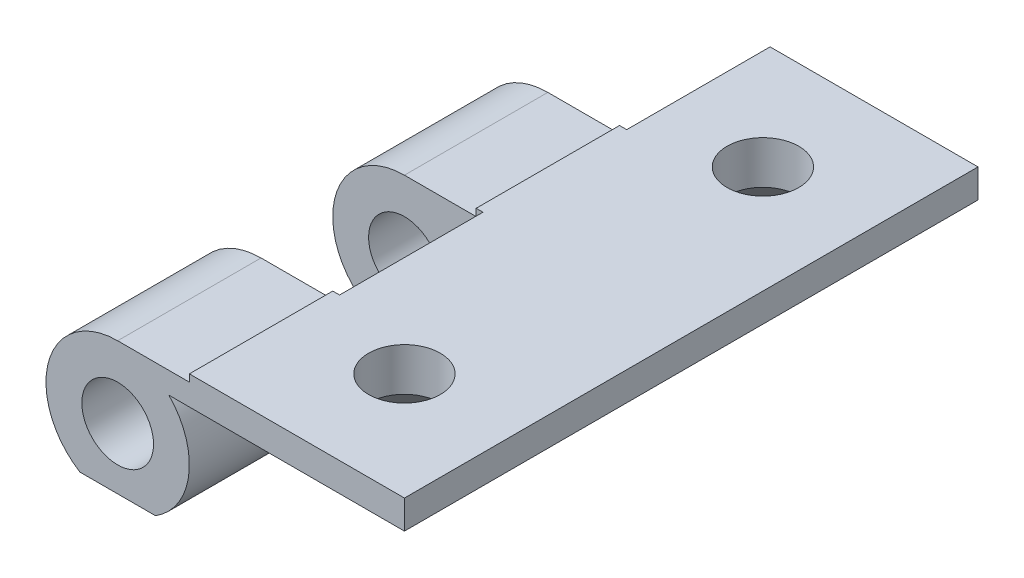
ISO-10303-21;
HEADER;
FILE_DESCRIPTION(('STEP AP214'),'2;1');
FILE_NAME('part.step','',(''),(''),'','','');
FILE_SCHEMA(('AUTOMOTIVE_DESIGN { 1 0 10303 214 1 1 1 1 }'));
ENDSEC;
DATA;
#1=APPLICATION_CONTEXT('core data for automotive mechanical design processes');
#2=APPLICATION_PROTOCOL_DEFINITION('international standard','automotive_design',2000,#1);
#3=PRODUCT_CONTEXT('',#1,'mechanical');
#4=PRODUCT('Part','Part','',(#3));
#5=PRODUCT_RELATED_PRODUCT_CATEGORY('part','',(#4));
#6=PRODUCT_DEFINITION_FORMATION('','',#4);
#7=PRODUCT_DEFINITION_CONTEXT('part definition',#1,'design');
#8=PRODUCT_DEFINITION('design','',#6,#7);
#9=PRODUCT_DEFINITION_SHAPE('','',#8);
#10=(LENGTH_UNIT() NAMED_UNIT(*) SI_UNIT(.MILLI.,.METRE.));
#11=(NAMED_UNIT(*) PLANE_ANGLE_UNIT() SI_UNIT($,.RADIAN.));
#12=(NAMED_UNIT(*) SI_UNIT($,.STERADIAN.) SOLID_ANGLE_UNIT());
#13=UNCERTAINTY_MEASURE_WITH_UNIT(LENGTH_MEASURE(1.E-05),#10,'distance_accuracy_value','');
#14=(GEOMETRIC_REPRESENTATION_CONTEXT(3) GLOBAL_UNCERTAINTY_ASSIGNED_CONTEXT((#13)) GLOBAL_UNIT_ASSIGNED_CONTEXT((#10,
#11,#12)) REPRESENTATION_CONTEXT('',''));
#15=CARTESIAN_POINT('',(0.,0.,0.));
#16=DIRECTION('',(0.,0.,1.));
#17=DIRECTION('',(1.,0.,0.));
#18=AXIS2_PLACEMENT_3D('',#15,#16,#17);
#19=CARTESIAN_POINT('',(20.,0.500000000000001,40.));
#20=DIRECTION('',(0.,1.,0.));
#21=DIRECTION('',(0.,0.,1.));
#22=AXIS2_PLACEMENT_3D('',#19,#20,#21);
#23=PLANE('',#22);
#24=DIRECTION('',(1.,0.,0.));
#25=VECTOR('',#24,1.);
#26=CARTESIAN_POINT('',(20.,0.500000000000001,3.00000000000002));
#27=LINE('',#26,#25);
#28=CARTESIAN_POINT('',(5.5,0.500000000000001,3.00000000000002));
#29=VERTEX_POINT('',#28);
#30=CARTESIAN_POINT('',(12.5,0.500000000000001,3.00000000000002));
#31=VERTEX_POINT('',#30);
#32=EDGE_CURVE('E288',#29,#31,#27,.T.);
#33=ORIENTED_EDGE('',*,*,#32,.T.);
#34=CARTESIAN_POINT('',(12.5,0.500000000000001,7.5));
#35=DIRECTION('',(0.,1.,0.));
#36=DIRECTION('',(0.,0.,1.));
#37=AXIS2_PLACEMENT_3D('',#34,#35,#36);
#38=CIRCLE('',#37,4.50000000000001);
#39=CARTESIAN_POINT('',(17.,0.500000000000001,7.5));
#40=VERTEX_POINT('',#39);
#41=EDGE_CURVE('E52',#31,#40,#38,.T.);
#42=ORIENTED_EDGE('',*,*,#41,.T.);
#43=DIRECTION('',(0.,0.,1.));
#44=VECTOR('',#43,1.);
#45=CARTESIAN_POINT('',(17.,0.500000000000001,40.));
#46=LINE('',#45,#44);
#47=CARTESIAN_POINT('',(17.,0.500000000000001,32.5));
#48=VERTEX_POINT('',#47);
#49=EDGE_CURVE('E287',#40,#48,#46,.T.);
#50=ORIENTED_EDGE('',*,*,#49,.T.);
#51=CARTESIAN_POINT('',(12.5,0.500000000000001,32.5));
#52=DIRECTION('',(0.,1.,0.));
#53=DIRECTION('',(0.,0.,1.));
#54=AXIS2_PLACEMENT_3D('',#51,#52,#53);
#55=CIRCLE('',#54,4.50000000000001);
#56=CARTESIAN_POINT('',(12.5,0.500000000000001,37.));
#57=VERTEX_POINT('',#56);
#58=EDGE_CURVE('E59',#48,#57,#55,.T.);
#59=ORIENTED_EDGE('',*,*,#58,.T.);
#60=DIRECTION('',(-1.,0.,0.));
#61=VECTOR('',#60,1.);
#62=CARTESIAN_POINT('',(4.9749371855331,0.500000000000001,37.));
#63=LINE('',#62,#61);
#64=CARTESIAN_POINT('',(4.9749371855331,0.500000000000001,37.));
#65=VERTEX_POINT('',#64);
#66=EDGE_CURVE('E276',#57,#65,#63,.T.);
#67=ORIENTED_EDGE('',*,*,#66,.T.);
#68=DIRECTION('',(0.,0.,-1.));
#69=VECTOR('',#68,1.);
#70=CARTESIAN_POINT('',(4.9749371855331,0.500000000000001,40.));
#71=LINE('',#70,#69);
#72=CARTESIAN_POINT('',(4.9749371855331,0.500000000000001,30.));
#73=VERTEX_POINT('',#72);
#74=EDGE_CURVE('E252',#65,#73,#71,.T.);
#75=ORIENTED_EDGE('',*,*,#74,.T.);
#76=DIRECTION('',(1.,0.,0.));
#77=VECTOR('',#76,1.);
#78=CARTESIAN_POINT('',(20.,0.500000000000001,30.));
#79=LINE('',#78,#77);
#80=CARTESIAN_POINT('',(5.4749371855331,0.500000000000001,30.));
#81=VERTEX_POINT('',#80);
#82=EDGE_CURVE('E433',#73,#81,#79,.T.);
#83=ORIENTED_EDGE('',*,*,#82,.T.);
#84=DIRECTION('',(0.,0.,1.));
#85=VECTOR('',#84,1.);
#86=CARTESIAN_POINT('',(5.4749371855331,0.500000000000001,30.));
#87=LINE('',#86,#85);
#88=CARTESIAN_POINT('',(5.4749371855331,0.500000000000001,20.));
#89=VERTEX_POINT('',#88);
#90=EDGE_CURVE('E513',#89,#81,#87,.T.);
#91=ORIENTED_EDGE('',*,*,#90,.F.);
#92=DIRECTION('',(-1.,0.,0.));
#93=VECTOR('',#92,1.);
#94=CARTESIAN_POINT('',(20.,0.500000000000001,20.));
#95=LINE('',#94,#93);
#96=CARTESIAN_POINT('',(4.9749371855331,0.500000000000001,20.));
#97=VERTEX_POINT('',#96);
#98=EDGE_CURVE('E416',#89,#97,#95,.T.);
#99=ORIENTED_EDGE('',*,*,#98,.T.);
#100=CARTESIAN_POINT('',(4.9749371855331,0.500000000000001,9.99999999999999));
#101=VERTEX_POINT('',#100);
#102=EDGE_CURVE('E251',#97,#101,#71,.T.);
#103=ORIENTED_EDGE('',*,*,#102,.T.);
#104=DIRECTION('',(1.,0.,0.));
#105=VECTOR('',#104,1.);
#106=CARTESIAN_POINT('',(20.,0.500000000000001,9.99999999999999));
#107=LINE('',#106,#105);
#108=CARTESIAN_POINT('',(5.5,0.500000000000001,9.99999999999999));
#109=VERTEX_POINT('',#108);
#110=EDGE_CURVE('E400',#101,#109,#107,.T.);
#111=ORIENTED_EDGE('',*,*,#110,.T.);
#112=DIRECTION('',(0.,0.,1.));
#113=VECTOR('',#112,1.);
#114=CARTESIAN_POINT('',(5.5,0.500000000000001,9.99999999999999));
#115=LINE('',#114,#113);
#116=EDGE_CURVE('E205',#29,#109,#115,.T.);
#117=ORIENTED_EDGE('',*,*,#116,.F.);
#118=EDGE_LOOP('',(#33,#42,#50,#59,#67,#75,#83,#91,#99,#103,#111,#117));
#119=FACE_BOUND('',#118,.T.);
#120=ADVANCED_FACE('F43',(#119),#23,.F.);
#121=CARTESIAN_POINT('',(17.,0.500000000000001,37.));
#122=VERTEX_POINT('',#121);
#123=EDGE_CURVE('E277',#122,#57,#63,.T.);
#124=ORIENTED_EDGE('',*,*,#123,.T.);
#125=CARTESIAN_POINT('',(12.5,0.500000000000001,32.5));
#126=DIRECTION('',(0.,1.,0.));
#127=DIRECTION('',(0.,0.,1.));
#128=AXIS2_PLACEMENT_3D('',#125,#126,#127);
#129=CIRCLE('',#128,4.50000000000001);
#130=EDGE_CURVE('E326',#57,#48,#129,.T.);
#131=ORIENTED_EDGE('',*,*,#130,.T.);
#132=EDGE_CURVE('E281',#48,#122,#46,.T.);
#133=ORIENTED_EDGE('',*,*,#132,.T.);
#134=EDGE_LOOP('',(#124,#131,#133));
#135=FACE_BOUND('',#134,.T.);
#136=ADVANCED_FACE('F366',(#135),#23,.F.);
#137=CARTESIAN_POINT('',(5.,5.5,40.));
#138=DIRECTION('',(1.,0.,0.));
#139=DIRECTION('',(0.,0.,-1.));
#140=AXIS2_PLACEMENT_3D('',#137,#138,#139);
#141=PLANE('',#140);
#142=DIRECTION('',(0.,0.,-1.));
#143=VECTOR('',#142,1.);
#144=CARTESIAN_POINT('',(5.,5.5,40.));
#145=LINE('',#144,#143);
#146=CARTESIAN_POINT('',(5.,5.5,40.));
#147=VERTEX_POINT('',#146);
#148=CARTESIAN_POINT('',(5.,5.5,30.));
#149=VERTEX_POINT('',#148);
#150=EDGE_CURVE('E245',#147,#149,#145,.T.);
#151=ORIENTED_EDGE('',*,*,#150,.T.);
#152=DIRECTION('',(0.,-1.,0.));
#153=VECTOR('',#152,1.);
#154=CARTESIAN_POINT('',(5.,5.5,30.));
#155=LINE('',#154,#153);
#156=CARTESIAN_POINT('',(5.,5.,30.));
#157=VERTEX_POINT('',#156);
#158=EDGE_CURVE('E304',#149,#157,#155,.T.);
#159=ORIENTED_EDGE('',*,*,#158,.T.);
#160=DIRECTION('',(0.,0.,-1.));
#161=VECTOR('',#160,1.);
#162=CARTESIAN_POINT('',(5.,5.,40.));
#163=LINE('',#162,#161);
#164=CARTESIAN_POINT('',(5.,5.,40.));
#165=VERTEX_POINT('',#164);
#166=EDGE_CURVE('E240',#165,#157,#163,.T.);
#167=ORIENTED_EDGE('',*,*,#166,.F.);
#168=DIRECTION('',(0.,-1.,0.));
#169=VECTOR('',#168,1.);
#170=CARTESIAN_POINT('',(5.,5.5,40.));
#171=LINE('',#170,#169);
#172=EDGE_CURVE('E451',#147,#165,#171,.T.);
#173=ORIENTED_EDGE('',*,*,#172,.F.);
#174=EDGE_LOOP('',(#151,#159,#167,#173));
#175=FACE_BOUND('',#174,.T.);
#176=ADVANCED_FACE('F549',(#175),#141,.F.);
#177=CARTESIAN_POINT('',(0.,0.,40.));
#178=DIRECTION('',(0.,0.,-1.));
#179=DIRECTION('',(-1.,0.,0.));
#180=AXIS2_PLACEMENT_3D('',#177,#178,#179);
#181=CYLINDRICAL_SURFACE('',#180,5.);
#182=CARTESIAN_POINT('',(0.,0.,30.));
#183=DIRECTION('',(0.,0.,1.));
#184=DIRECTION('',(1.,0.,0.));
#185=AXIS2_PLACEMENT_3D('',#182,#183,#184);
#186=CIRCLE('',#185,5.);
#187=CARTESIAN_POINT('',(2.63391343821319,-4.25,30.));
#188=VERTEX_POINT('',#187);
#189=EDGE_CURVE('E436',#188,#73,#186,.T.);
#190=ORIENTED_EDGE('',*,*,#189,.T.);
#191=ORIENTED_EDGE('',*,*,#74,.F.);
#192=CARTESIAN_POINT('',(0.,0.,36.5));
#193=DIRECTION('',(0.,-0.707106781186549,0.707106781186546));
#194=DIRECTION('',(0.,-0.707106781186546,-0.707106781186549));
#195=AXIS2_PLACEMENT_3D('',#192,#193,#194);
#196=ELLIPSE('',#195,7.07106781186549,5.);
#197=CARTESIAN_POINT('',(3.57071421427142,3.5,40.));
#198=VERTEX_POINT('',#197);
#199=EDGE_CURVE('E300',#65,#198,#196,.T.);
#200=ORIENTED_EDGE('',*,*,#199,.T.);
#201=CARTESIAN_POINT('',(0.,0.,40.));
#202=DIRECTION('',(0.,0.,1.));
#203=DIRECTION('',(1.,0.,0.));
#204=AXIS2_PLACEMENT_3D('',#201,#202,#203);
#205=CIRCLE('',#204,5.);
#206=CARTESIAN_POINT('',(2.63391343821319,-4.25,40.));
#207=VERTEX_POINT('',#206);
#208=EDGE_CURVE('E223',#207,#198,#205,.T.);
#209=ORIENTED_EDGE('',*,*,#208,.F.);
#210=DIRECTION('',(0.,0.,-1.));
#211=VECTOR('',#210,1.);
#212=CARTESIAN_POINT('',(2.63391343821319,-4.25,40.));
#213=LINE('',#212,#211);
#214=EDGE_CURVE('E260',#207,#188,#213,.T.);
#215=ORIENTED_EDGE('',*,*,#214,.T.);
#216=EDGE_LOOP('',(#190,#191,#200,#209,#215));
#217=FACE_BOUND('',#216,.T.);
#218=ADVANCED_FACE('F502',(#217),#181,.T.);
#219=DIRECTION('',(0.,0.,-1.));
#220=VECTOR('',#219,1.);
#221=CARTESIAN_POINT('',(0.,5.,40.));
#222=LINE('',#221,#220);
#223=CARTESIAN_POINT('',(0.,5.,40.));
#224=VERTEX_POINT('',#223);
#225=CARTESIAN_POINT('',(0.,5.,30.));
#226=VERTEX_POINT('',#225);
#227=EDGE_CURVE('E234',#224,#226,#222,.T.);
#228=ORIENTED_EDGE('',*,*,#227,.T.);
#229=CARTESIAN_POINT('',(0.,0.,30.));
#230=DIRECTION('',(0.,0.,1.));
#231=DIRECTION('',(1.,0.,0.));
#232=AXIS2_PLACEMENT_3D('',#229,#230,#231);
#233=CIRCLE('',#232,5.);
#234=CARTESIAN_POINT('',(-2.63391343821319,-4.25,30.));
#235=VERTEX_POINT('',#234);
#236=EDGE_CURVE('E430',#226,#235,#233,.T.);
#237=ORIENTED_EDGE('',*,*,#236,.T.);
#238=DIRECTION('',(0.,0.,-1.));
#239=VECTOR('',#238,1.);
#240=CARTESIAN_POINT('',(-2.63391343821319,-4.25,40.));
#241=LINE('',#240,#239);
#242=CARTESIAN_POINT('',(-2.63391343821319,-4.25,40.));
#243=VERTEX_POINT('',#242);
#244=EDGE_CURVE('E255',#235,#243,#241,.F.);
#245=ORIENTED_EDGE('',*,*,#244,.T.);
#246=EDGE_CURVE('E228',#224,#243,#205,.T.);
#247=ORIENTED_EDGE('',*,*,#246,.F.);
#248=EDGE_LOOP('',(#228,#237,#245,#247));
#249=FACE_BOUND('',#248,.T.);
#250=ADVANCED_FACE('F571',(#249),#181,.T.);
#251=CARTESIAN_POINT('',(0.,5.,40.));
#252=DIRECTION('',(0.,-1.,0.));
#253=DIRECTION('',(0.,0.,-1.));
#254=AXIS2_PLACEMENT_3D('',#251,#252,#253);
#255=PLANE('',#254);
#256=ORIENTED_EDGE('',*,*,#166,.T.);
#257=DIRECTION('',(-1.,0.,0.));
#258=VECTOR('',#257,1.);
#259=CARTESIAN_POINT('',(0.,5.,30.));
#260=LINE('',#259,#258);
#261=EDGE_CURVE('E427',#157,#226,#260,.T.);
#262=ORIENTED_EDGE('',*,*,#261,.T.);
#263=ORIENTED_EDGE('',*,*,#227,.F.);
#264=DIRECTION('',(-1.,0.,0.));
#265=VECTOR('',#264,1.);
#266=CARTESIAN_POINT('',(0.,5.,40.));
#267=LINE('',#266,#265);
#268=EDGE_CURVE('E453',#165,#224,#267,.T.);
#269=ORIENTED_EDGE('',*,*,#268,.F.);
#270=EDGE_LOOP('',(#256,#262,#263,#269));
#271=FACE_BOUND('',#270,.T.);
#272=ADVANCED_FACE('F561',(#271),#255,.F.);
#273=CARTESIAN_POINT('',(0.,0.,40.));
#274=DIRECTION('',(0.,0.,-1.));
#275=DIRECTION('',(-1.,0.,0.));
#276=AXIS2_PLACEMENT_3D('',#273,#274,#275);
#277=CYLINDRICAL_SURFACE('',#276,2.5);
#278=CARTESIAN_POINT('',(0.,0.,30.));
#279=DIRECTION('',(0.,0.,1.));
#280=DIRECTION('',(1.,0.,0.));
#281=AXIS2_PLACEMENT_3D('',#278,#279,#280);
#282=CIRCLE('',#281,2.5);
#283=CARTESIAN_POINT('',(2.5,0.,30.));
#284=VERTEX_POINT('',#283);
#285=EDGE_CURVE('E423',#284,#284,#282,.T.);
#286=ORIENTED_EDGE('',*,*,#285,.F.);
#287=EDGE_LOOP('',(#286));
#288=FACE_BOUND('',#287,.T.);
#289=CARTESIAN_POINT('',(0.,0.,40.));
#290=DIRECTION('',(0.,0.,1.));
#291=DIRECTION('',(1.,0.,0.));
#292=AXIS2_PLACEMENT_3D('',#289,#290,#291);
#293=CIRCLE('',#292,2.5);
#294=CARTESIAN_POINT('',(2.5,0.,40.));
#295=VERTEX_POINT('',#294);
#296=EDGE_CURVE('E230',#295,#295,#293,.T.);
#297=ORIENTED_EDGE('',*,*,#296,.T.);
#298=EDGE_LOOP('',(#297));
#299=FACE_BOUND('',#298,.T.);
#300=ADVANCED_FACE('F558',(#288,#299),#277,.F.);
#301=CARTESIAN_POINT('',(-6.33676251112338,-4.25,100.405530582886));
#302=DIRECTION('',(0.,1.,0.));
#303=DIRECTION('',(0.,0.,1.));
#304=AXIS2_PLACEMENT_3D('',#301,#302,#303);
#305=PLANE('',#304);
#306=ORIENTED_EDGE('',*,*,#244,.F.);
#307=DIRECTION('',(1.,0.,0.));
#308=VECTOR('',#307,1.);
#309=CARTESIAN_POINT('',(-6.33676251112338,-4.25,30.));
#310=LINE('',#309,#308);
#311=EDGE_CURVE('E268',#235,#188,#310,.T.);
#312=ORIENTED_EDGE('',*,*,#311,.T.);
#313=ORIENTED_EDGE('',*,*,#214,.F.);
#314=DIRECTION('',(-1.,0.,0.));
#315=VECTOR('',#314,1.);
#316=CARTESIAN_POINT('',(0.,-4.25,40.));
#317=LINE('',#316,#315);
#318=EDGE_CURVE('E440',#207,#243,#317,.T.);
#319=ORIENTED_EDGE('',*,*,#318,.T.);
#320=EDGE_LOOP('',(#306,#312,#313,#319));
#321=FACE_BOUND('',#320,.T.);
#322=ADVANCED_FACE('F560',(#321),#305,.F.);
#323=CARTESIAN_POINT('',(0.,0.,9.99999999999999));
#324=DIRECTION('',(0.,0.,1.));
#325=DIRECTION('',(1.,0.,0.));
#326=AXIS2_PLACEMENT_3D('',#323,#324,#325);
#327=CIRCLE('',#326,5.);
#328=CARTESIAN_POINT('',(2.63391343821319,-4.25,9.99999999999999));
#329=VERTEX_POINT('',#328);
#330=EDGE_CURVE('E403',#329,#101,#327,.T.);
#331=ORIENTED_EDGE('',*,*,#330,.T.);
#332=ORIENTED_EDGE('',*,*,#102,.F.);
#333=CARTESIAN_POINT('',(0.,0.,20.));
#334=DIRECTION('',(0.,0.,-1.));
#335=DIRECTION('',(-1.,0.,0.));
#336=AXIS2_PLACEMENT_3D('',#333,#334,#335);
#337=CIRCLE('',#336,5.);
#338=CARTESIAN_POINT('',(2.63391343821319,-4.25,20.));
#339=VERTEX_POINT('',#338);
#340=EDGE_CURVE('E420',#97,#339,#337,.T.);
#341=ORIENTED_EDGE('',*,*,#340,.T.);
#342=EDGE_CURVE('E259',#339,#329,#213,.T.);
#343=ORIENTED_EDGE('',*,*,#342,.T.);
#344=EDGE_LOOP('',(#331,#332,#341,#343));
#345=FACE_BOUND('',#344,.T.);
#346=ADVANCED_FACE('F544',(#345),#181,.T.);
#347=CARTESIAN_POINT('',(0.,0.,40.));
#348=DIRECTION('',(0.,0.,1.));
#349=DIRECTION('',(1.,0.,0.));
#350=AXIS2_PLACEMENT_3D('',#347,#348,#349);
#351=PLANE('',#350);
#352=ORIENTED_EDGE('',*,*,#208,.T.);
#353=DIRECTION('',(1.,0.,0.));
#354=VECTOR('',#353,1.);
#355=CARTESIAN_POINT('',(20.,3.5,40.));
#356=LINE('',#355,#354);
#357=CARTESIAN_POINT('',(20.,3.5,40.));
#358=VERTEX_POINT('',#357);
#359=EDGE_CURVE('E297',#198,#358,#356,.T.);
#360=ORIENTED_EDGE('',*,*,#359,.T.);
#361=DIRECTION('',(0.,1.,0.));
#362=VECTOR('',#361,1.);
#363=CARTESIAN_POINT('',(20.,5.,40.));
#364=LINE('',#363,#362);
#365=CARTESIAN_POINT('',(20.,5.5,40.));
#366=VERTEX_POINT('',#365);
#367=EDGE_CURVE('E355',#358,#366,#364,.T.);
#368=ORIENTED_EDGE('',*,*,#367,.T.);
#369=DIRECTION('',(-1.,0.,0.));
#370=VECTOR('',#369,1.);
#371=CARTESIAN_POINT('',(20.,5.5,40.));
#372=LINE('',#371,#370);
#373=EDGE_CURVE('E358',#366,#147,#372,.T.);
#374=ORIENTED_EDGE('',*,*,#373,.T.);
#375=ORIENTED_EDGE('',*,*,#172,.T.);
#376=ORIENTED_EDGE('',*,*,#268,.T.);
#377=ORIENTED_EDGE('',*,*,#246,.T.);
#378=ORIENTED_EDGE('',*,*,#318,.F.);
#379=EDGE_LOOP('',(#352,#360,#368,#374,#375,#376,#377,#378));
#380=FACE_BOUND('',#379,.T.);
#381=ORIENTED_EDGE('',*,*,#296,.F.);
#382=EDGE_LOOP('',(#381));
#383=FACE_BOUND('',#382,.T.);
#384=ADVANCED_FACE('F551',(#380,#383),#351,.T.);
#385=CARTESIAN_POINT('',(0.,0.,0.));
#386=DIRECTION('',(0.,0.,1.));
#387=DIRECTION('',(1.,0.,0.));
#388=AXIS2_PLACEMENT_3D('',#385,#386,#387);
#389=PLANE('',#388);
#390=DIRECTION('',(-1.,0.,0.));
#391=VECTOR('',#390,1.);
#392=CARTESIAN_POINT('',(0.,3.5,0.));
#393=LINE('',#392,#391);
#394=CARTESIAN_POINT('',(20.,3.5,0.));
#395=VERTEX_POINT('',#394);
#396=CARTESIAN_POINT('',(5.5,3.5,0.));
#397=VERTEX_POINT('',#396);
#398=EDGE_CURVE('E214',#395,#397,#393,.T.);
#399=ORIENTED_EDGE('',*,*,#398,.T.);
#400=DIRECTION('',(0.,-1.,0.));
#401=VECTOR('',#400,1.);
#402=CARTESIAN_POINT('',(5.5,5.5,0.));
#403=LINE('',#402,#401);
#404=CARTESIAN_POINT('',(5.5,5.5,0.));
#405=VERTEX_POINT('',#404);
#406=EDGE_CURVE('E194',#405,#397,#403,.T.);
#407=ORIENTED_EDGE('',*,*,#406,.F.);
#408=DIRECTION('',(-1.,0.,0.));
#409=VECTOR('',#408,1.);
#410=CARTESIAN_POINT('',(20.,5.5,0.));
#411=LINE('',#410,#409);
#412=CARTESIAN_POINT('',(20.,5.5,0.));
#413=VERTEX_POINT('',#412);
#414=EDGE_CURVE('E212',#413,#405,#411,.T.);
#415=ORIENTED_EDGE('',*,*,#414,.F.);
#416=DIRECTION('',(0.,1.,0.));
#417=VECTOR('',#416,1.);
#418=CARTESIAN_POINT('',(20.,5.,0.));
#419=LINE('',#418,#417);
#420=EDGE_CURVE('E224',#395,#413,#419,.T.);
#421=ORIENTED_EDGE('',*,*,#420,.F.);
#422=EDGE_LOOP('',(#399,#407,#415,#421));
#423=FACE_BOUND('',#422,.T.);
#424=ADVANCED_FACE('F210',(#423),#389,.F.);
#425=CARTESIAN_POINT('',(0.,5.,20.));
#426=VERTEX_POINT('',#425);
#427=CARTESIAN_POINT('',(0.,5.,9.99999999999999));
#428=VERTEX_POINT('',#427);
#429=EDGE_CURVE('E239',#426,#428,#222,.T.);
#430=ORIENTED_EDGE('',*,*,#429,.T.);
#431=CARTESIAN_POINT('',(0.,0.,9.99999999999999));
#432=DIRECTION('',(0.,0.,1.));
#433=DIRECTION('',(1.,0.,0.));
#434=AXIS2_PLACEMENT_3D('',#431,#432,#433);
#435=CIRCLE('',#434,5.);
#436=CARTESIAN_POINT('',(-2.63391343821319,-4.25,10.));
#437=VERTEX_POINT('',#436);
#438=EDGE_CURVE('E397',#428,#437,#435,.T.);
#439=ORIENTED_EDGE('',*,*,#438,.T.);
#440=CARTESIAN_POINT('',(-2.63391343821319,-4.25,20.));
#441=VERTEX_POINT('',#440);
#442=EDGE_CURVE('E256',#437,#441,#241,.F.);
#443=ORIENTED_EDGE('',*,*,#442,.T.);
#444=CARTESIAN_POINT('',(0.,0.,20.));
#445=DIRECTION('',(0.,0.,-1.));
#446=DIRECTION('',(-1.,0.,0.));
#447=AXIS2_PLACEMENT_3D('',#444,#445,#446);
#448=CIRCLE('',#447,5.);
#449=EDGE_CURVE('E413',#441,#426,#448,.T.);
#450=ORIENTED_EDGE('',*,*,#449,.T.);
#451=EDGE_LOOP('',(#430,#439,#443,#450));
#452=FACE_BOUND('',#451,.T.);
#453=ADVANCED_FACE('F461',(#452),#181,.T.);
#454=CARTESIAN_POINT('',(17.,0.500000000000001,3.00000000000002));
#455=VERTEX_POINT('',#454);
#456=EDGE_CURVE('E282',#455,#40,#46,.T.);
#457=ORIENTED_EDGE('',*,*,#456,.T.);
#458=CARTESIAN_POINT('',(12.5,0.500000000000001,7.5));
#459=DIRECTION('',(0.,1.,0.));
#460=DIRECTION('',(0.,0.,1.));
#461=AXIS2_PLACEMENT_3D('',#458,#459,#460);
#462=CIRCLE('',#461,4.50000000000001);
#463=EDGE_CURVE('E329',#40,#31,#462,.T.);
#464=ORIENTED_EDGE('',*,*,#463,.T.);
#465=EDGE_CURVE('E286',#31,#455,#27,.T.);
#466=ORIENTED_EDGE('',*,*,#465,.T.);
#467=EDGE_LOOP('',(#457,#464,#466));
#468=FACE_BOUND('',#467,.T.);
#469=ADVANCED_FACE('F345',(#468),#23,.F.);
#470=CARTESIAN_POINT('',(20.,5.,40.));
#471=DIRECTION('',(-1.,0.,0.));
#472=DIRECTION('',(0.,0.,1.));
#473=AXIS2_PLACEMENT_3D('',#470,#471,#472);
#474=PLANE('',#473);
#475=ORIENTED_EDGE('',*,*,#367,.F.);
#476=DIRECTION('',(0.,0.,-1.));
#477=VECTOR('',#476,1.);
#478=CARTESIAN_POINT('',(20.,3.5,40.));
#479=LINE('',#478,#477);
#480=EDGE_CURVE('E294',#358,#395,#479,.T.);
#481=ORIENTED_EDGE('',*,*,#480,.T.);
#482=ORIENTED_EDGE('',*,*,#420,.T.);
#483=DIRECTION('',(0.,0.,-1.));
#484=VECTOR('',#483,1.);
#485=CARTESIAN_POINT('',(20.,5.5,40.));
#486=LINE('',#485,#484);
#487=EDGE_CURVE('E221',#366,#413,#486,.T.);
#488=ORIENTED_EDGE('',*,*,#487,.F.);
#489=EDGE_LOOP('',(#475,#481,#482,#488));
#490=FACE_BOUND('',#489,.T.);
#491=ADVANCED_FACE('F354',(#490),#474,.F.);
#492=CARTESIAN_POINT('',(20.,5.5,40.));
#493=DIRECTION('',(0.,-1.,0.));
#494=DIRECTION('',(0.,0.,-1.));
#495=AXIS2_PLACEMENT_3D('',#492,#493,#494);
#496=PLANE('',#495);
#497=CARTESIAN_POINT('',(12.5,5.5,32.5));
#498=DIRECTION('',(0.,-1.,0.));
#499=DIRECTION('',(0.,0.,1.));
#500=AXIS2_PLACEMENT_3D('',#497,#498,#499);
#501=CIRCLE('',#500,2.5);
#502=CARTESIAN_POINT('',(12.5,5.5,35.));
#503=VERTEX_POINT('',#502);
#504=EDGE_CURVE('E314',#503,#503,#501,.T.);
#505=ORIENTED_EDGE('',*,*,#504,.T.);
#506=EDGE_LOOP('',(#505));
#507=FACE_BOUND('',#506,.T.);
#508=CARTESIAN_POINT('',(12.5,5.5,7.5));
#509=DIRECTION('',(0.,-1.,0.));
#510=DIRECTION('',(0.,0.,-1.));
#511=AXIS2_PLACEMENT_3D('',#508,#509,#510);
#512=CIRCLE('',#511,2.5);
#513=CARTESIAN_POINT('',(12.5,5.5,5.));
#514=VERTEX_POINT('',#513);
#515=EDGE_CURVE('E381',#514,#514,#512,.T.);
#516=ORIENTED_EDGE('',*,*,#515,.T.);
#517=EDGE_LOOP('',(#516));
#518=FACE_BOUND('',#517,.T.);
#519=DIRECTION('',(0.,0.,1.));
#520=VECTOR('',#519,1.);
#521=CARTESIAN_POINT('',(5.5,5.5,9.99999999999999));
#522=LINE('',#521,#520);
#523=CARTESIAN_POINT('',(5.5,5.5,9.99999999999999));
#524=VERTEX_POINT('',#523);
#525=EDGE_CURVE('E191',#405,#524,#522,.T.);
#526=ORIENTED_EDGE('',*,*,#525,.T.);
#527=DIRECTION('',(-1.,0.,0.));
#528=VECTOR('',#527,1.);
#529=CARTESIAN_POINT('',(5.,5.5,9.99999999999999));
#530=LINE('',#529,#528);
#531=CARTESIAN_POINT('',(5.,5.5,9.99999999999999));
#532=VERTEX_POINT('',#531);
#533=EDGE_CURVE('E204',#524,#532,#530,.T.);
#534=ORIENTED_EDGE('',*,*,#533,.T.);
#535=CARTESIAN_POINT('',(5.,5.5,20.));
#536=VERTEX_POINT('',#535);
#537=EDGE_CURVE('E244',#536,#532,#145,.T.);
#538=ORIENTED_EDGE('',*,*,#537,.F.);
#539=DIRECTION('',(1.,0.,0.));
#540=VECTOR('',#539,1.);
#541=CARTESIAN_POINT('',(4.9749371855331,5.5,20.));
#542=LINE('',#541,#540);
#543=CARTESIAN_POINT('',(5.4749371855331,5.5,20.));
#544=VERTEX_POINT('',#543);
#545=EDGE_CURVE('E485',#536,#544,#542,.T.);
#546=ORIENTED_EDGE('',*,*,#545,.T.);
#547=DIRECTION('',(0.,0.,1.));
#548=VECTOR('',#547,1.);
#549=CARTESIAN_POINT('',(5.4749371855331,5.5,30.));
#550=LINE('',#549,#548);
#551=CARTESIAN_POINT('',(5.4749371855331,5.5,30.));
#552=VERTEX_POINT('',#551);
#553=EDGE_CURVE('E521',#544,#552,#550,.T.);
#554=ORIENTED_EDGE('',*,*,#553,.T.);
#555=DIRECTION('',(-1.,0.,0.));
#556=VECTOR('',#555,1.);
#557=CARTESIAN_POINT('',(4.9749371855331,5.5,30.));
#558=LINE('',#557,#556);
#559=EDGE_CURVE('E526',#552,#149,#558,.T.);
#560=ORIENTED_EDGE('',*,*,#559,.T.);
#561=ORIENTED_EDGE('',*,*,#150,.F.);
#562=ORIENTED_EDGE('',*,*,#373,.F.);
#563=ORIENTED_EDGE('',*,*,#487,.T.);
#564=ORIENTED_EDGE('',*,*,#414,.T.);
#565=EDGE_LOOP('',(#526,#534,#538,#546,#554,#560,#561,#562,#563,#564));
#566=FACE_BOUND('',#565,.T.);
#567=ADVANCED_FACE('F218',(#507,#518,#566),#496,.F.);
#568=ORIENTED_EDGE('',*,*,#537,.T.);
#569=DIRECTION('',(0.,-1.,0.));
#570=VECTOR('',#569,1.);
#571=CARTESIAN_POINT('',(5.,5.5,9.99999999999999));
#572=LINE('',#571,#570);
#573=CARTESIAN_POINT('',(5.,5.,9.99999999999999));
#574=VERTEX_POINT('',#573);
#575=EDGE_CURVE('E473',#532,#574,#572,.T.);
#576=ORIENTED_EDGE('',*,*,#575,.T.);
#577=CARTESIAN_POINT('',(5.,5.,20.));
#578=VERTEX_POINT('',#577);
#579=EDGE_CURVE('E238',#578,#574,#163,.T.);
#580=ORIENTED_EDGE('',*,*,#579,.F.);
#581=DIRECTION('',(0.,1.,0.));
#582=VECTOR('',#581,1.);
#583=CARTESIAN_POINT('',(5.,5.5,20.));
#584=LINE('',#583,#582);
#585=EDGE_CURVE('E310',#578,#536,#584,.T.);
#586=ORIENTED_EDGE('',*,*,#585,.T.);
#587=EDGE_LOOP('',(#568,#576,#580,#586));
#588=FACE_BOUND('',#587,.T.);
#589=ADVANCED_FACE('F491',(#588),#141,.F.);
#590=ORIENTED_EDGE('',*,*,#579,.T.);
#591=DIRECTION('',(-1.,0.,0.));
#592=VECTOR('',#591,1.);
#593=CARTESIAN_POINT('',(0.,5.,9.99999999999999));
#594=LINE('',#593,#592);
#595=EDGE_CURVE('E393',#574,#428,#594,.T.);
#596=ORIENTED_EDGE('',*,*,#595,.T.);
#597=ORIENTED_EDGE('',*,*,#429,.F.);
#598=DIRECTION('',(1.,0.,0.));
#599=VECTOR('',#598,1.);
#600=CARTESIAN_POINT('',(0.,5.,20.));
#601=LINE('',#600,#599);
#602=EDGE_CURVE('E410',#426,#578,#601,.T.);
#603=ORIENTED_EDGE('',*,*,#602,.T.);
#604=EDGE_LOOP('',(#590,#596,#597,#603));
#605=FACE_BOUND('',#604,.T.);
#606=ADVANCED_FACE('F467',(#605),#255,.F.);
#607=CARTESIAN_POINT('',(0.,0.,9.99999999999999));
#608=DIRECTION('',(0.,0.,1.));
#609=DIRECTION('',(1.,0.,0.));
#610=AXIS2_PLACEMENT_3D('',#607,#608,#609);
#611=CIRCLE('',#610,2.5);
#612=CARTESIAN_POINT('',(2.5,0.,9.99999999999999));
#613=VERTEX_POINT('',#612);
#614=EDGE_CURVE('E385',#613,#613,#611,.T.);
#615=ORIENTED_EDGE('',*,*,#614,.F.);
#616=EDGE_LOOP('',(#615));
#617=FACE_BOUND('',#616,.T.);
#618=CARTESIAN_POINT('',(0.,0.,20.));
#619=DIRECTION('',(0.,0.,-1.));
#620=DIRECTION('',(-1.,0.,0.));
#621=AXIS2_PLACEMENT_3D('',#618,#619,#620);
#622=CIRCLE('',#621,2.5);
#623=CARTESIAN_POINT('',(-2.5,0.,20.));
#624=VERTEX_POINT('',#623);
#625=EDGE_CURVE('E406',#624,#624,#622,.T.);
#626=ORIENTED_EDGE('',*,*,#625,.F.);
#627=EDGE_LOOP('',(#626));
#628=FACE_BOUND('',#627,.T.);
#629=ADVANCED_FACE('F564',(#617,#628),#277,.F.);
#630=ORIENTED_EDGE('',*,*,#442,.F.);
#631=DIRECTION('',(1.,0.,0.));
#632=VECTOR('',#631,1.);
#633=CARTESIAN_POINT('',(-6.33676251112338,-4.25,9.99999999999999));
#634=LINE('',#633,#632);
#635=EDGE_CURVE('E272',#437,#329,#634,.T.);
#636=ORIENTED_EDGE('',*,*,#635,.T.);
#637=ORIENTED_EDGE('',*,*,#342,.F.);
#638=DIRECTION('',(-1.,0.,0.));
#639=VECTOR('',#638,1.);
#640=CARTESIAN_POINT('',(-6.33676251112333,-4.25,20.));
#641=LINE('',#640,#639);
#642=EDGE_CURVE('E264',#339,#441,#641,.T.);
#643=ORIENTED_EDGE('',*,*,#642,.T.);
#644=EDGE_LOOP('',(#630,#636,#637,#643));
#645=FACE_BOUND('',#644,.T.);
#646=ADVANCED_FACE('F479',(#645),#305,.F.);
#647=CARTESIAN_POINT('',(-5.,5.5,30.));
#648=DIRECTION('',(0.,0.,1.));
#649=DIRECTION('',(1.,0.,0.));
#650=AXIS2_PLACEMENT_3D('',#647,#648,#649);
#651=PLANE('',#650);
#652=ORIENTED_EDGE('',*,*,#285,.T.);
#653=EDGE_LOOP('',(#652));
#654=FACE_BOUND('',#653,.T.);
#655=ORIENTED_EDGE('',*,*,#236,.F.);
#656=ORIENTED_EDGE('',*,*,#261,.F.);
#657=ORIENTED_EDGE('',*,*,#158,.F.);
#658=ORIENTED_EDGE('',*,*,#559,.F.);
#659=DIRECTION('',(0.,-1.,0.));
#660=VECTOR('',#659,1.);
#661=CARTESIAN_POINT('',(5.4749371855331,5.5,30.));
#662=LINE('',#661,#660);
#663=EDGE_CURVE('E490',#552,#81,#662,.T.);
#664=ORIENTED_EDGE('',*,*,#663,.T.);
#665=ORIENTED_EDGE('',*,*,#82,.F.);
#666=ORIENTED_EDGE('',*,*,#189,.F.);
#667=ORIENTED_EDGE('',*,*,#311,.F.);
#668=EDGE_LOOP('',(#655,#656,#657,#658,#664,#665,#666,#667));
#669=FACE_BOUND('',#668,.T.);
#670=ADVANCED_FACE('F509',(#654,#669),#651,.F.);
#671=CARTESIAN_POINT('',(-4.99999999999999,5.5,20.));
#672=DIRECTION('',(0.,0.,-1.));
#673=DIRECTION('',(-1.,0.,0.));
#674=AXIS2_PLACEMENT_3D('',#671,#672,#673);
#675=PLANE('',#674);
#676=ORIENTED_EDGE('',*,*,#625,.T.);
#677=EDGE_LOOP('',(#676));
#678=FACE_BOUND('',#677,.T.);
#679=ORIENTED_EDGE('',*,*,#340,.F.);
#680=ORIENTED_EDGE('',*,*,#98,.F.);
#681=DIRECTION('',(0.,-1.,0.));
#682=VECTOR('',#681,1.);
#683=CARTESIAN_POINT('',(5.4749371855331,5.5,20.));
#684=LINE('',#683,#682);
#685=EDGE_CURVE('E529',#544,#89,#684,.T.);
#686=ORIENTED_EDGE('',*,*,#685,.F.);
#687=ORIENTED_EDGE('',*,*,#545,.F.);
#688=ORIENTED_EDGE('',*,*,#585,.F.);
#689=ORIENTED_EDGE('',*,*,#602,.F.);
#690=ORIENTED_EDGE('',*,*,#449,.F.);
#691=ORIENTED_EDGE('',*,*,#642,.F.);
#692=EDGE_LOOP('',(#679,#680,#686,#687,#688,#689,#690,#691));
#693=FACE_BOUND('',#692,.T.);
#694=ADVANCED_FACE('F482',(#678,#693),#675,.F.);
#695=CARTESIAN_POINT('',(5.,5.5,10.));
#696=DIRECTION('',(0.,0.,1.));
#697=DIRECTION('',(1.,0.,0.));
#698=AXIS2_PLACEMENT_3D('',#695,#696,#697);
#699=PLANE('',#698);
#700=ORIENTED_EDGE('',*,*,#614,.T.);
#701=EDGE_LOOP('',(#700));
#702=FACE_BOUND('',#701,.T.);
#703=ORIENTED_EDGE('',*,*,#635,.F.);
#704=ORIENTED_EDGE('',*,*,#438,.F.);
#705=ORIENTED_EDGE('',*,*,#595,.F.);
#706=ORIENTED_EDGE('',*,*,#575,.F.);
#707=ORIENTED_EDGE('',*,*,#533,.F.);
#708=DIRECTION('',(0.,-1.,0.));
#709=VECTOR('',#708,1.);
#710=CARTESIAN_POINT('',(5.5,5.5,9.99999999999999));
#711=LINE('',#710,#709);
#712=EDGE_CURVE('E198',#524,#109,#711,.T.);
#713=ORIENTED_EDGE('',*,*,#712,.T.);
#714=ORIENTED_EDGE('',*,*,#110,.F.);
#715=ORIENTED_EDGE('',*,*,#330,.F.);
#716=EDGE_LOOP('',(#703,#704,#705,#706,#707,#713,#714,#715));
#717=FACE_BOUND('',#716,.T.);
#718=ADVANCED_FACE('F472',(#702,#717),#699,.F.);
#719=CARTESIAN_POINT('',(12.5,5.5,7.5));
#720=DIRECTION('',(0.,-1.,0.));
#721=DIRECTION('',(0.,0.,-1.));
#722=AXIS2_PLACEMENT_3D('',#719,#720,#721);
#723=CYLINDRICAL_SURFACE('',#722,2.5);
#724=CARTESIAN_POINT('',(12.5,2.50000000000001,7.5));
#725=DIRECTION('',(0.,1.,0.));
#726=DIRECTION('',(0.,0.,1.));
#727=AXIS2_PLACEMENT_3D('',#724,#725,#726);
#728=CIRCLE('',#727,2.5);
#729=CARTESIAN_POINT('',(12.5,2.50000000000001,10.));
#730=VERTEX_POINT('',#729);
#731=EDGE_CURVE('E320',#730,#730,#728,.F.);
#732=ORIENTED_EDGE('',*,*,#731,.T.);
#733=EDGE_LOOP('',(#732));
#734=FACE_BOUND('',#733,.T.);
#735=ORIENTED_EDGE('',*,*,#515,.F.);
#736=EDGE_LOOP('',(#735));
#737=FACE_BOUND('',#736,.T.);
#738=ADVANCED_FACE('F375',(#734,#737),#723,.F.);
#739=CARTESIAN_POINT('',(12.5,5.5,32.5));
#740=DIRECTION('',(0.,-1.,0.));
#741=DIRECTION('',(0.,0.,-1.));
#742=AXIS2_PLACEMENT_3D('',#739,#740,#741);
#743=CYLINDRICAL_SURFACE('',#742,2.5);
#744=CARTESIAN_POINT('',(12.5,2.50000000000001,32.5));
#745=DIRECTION('',(0.,1.,0.));
#746=DIRECTION('',(0.,0.,1.));
#747=AXIS2_PLACEMENT_3D('',#744,#745,#746);
#748=CIRCLE('',#747,2.5);
#749=CARTESIAN_POINT('',(12.5,2.50000000000001,35.));
#750=VERTEX_POINT('',#749);
#751=EDGE_CURVE('E11',#750,#750,#748,.F.);
#752=ORIENTED_EDGE('',*,*,#751,.T.);
#753=EDGE_LOOP('',(#752));
#754=FACE_BOUND('',#753,.T.);
#755=ORIENTED_EDGE('',*,*,#504,.F.);
#756=EDGE_LOOP('',(#755));
#757=FACE_BOUND('',#756,.T.);
#758=ADVANCED_FACE('F372',(#754,#757),#743,.F.);
#759=CARTESIAN_POINT('',(0.,3.5,40.));
#760=DIRECTION('',(0.,-0.707106781186549,0.707106781186546));
#761=DIRECTION('',(-1.,0.,0.));
#762=AXIS2_PLACEMENT_3D('',#759,#760,#761);
#763=PLANE('',#762);
#764=ORIENTED_EDGE('',*,*,#199,.F.);
#765=ORIENTED_EDGE('',*,*,#66,.F.);
#766=ORIENTED_EDGE('',*,*,#123,.F.);
#767=DIRECTION('',(-0.577350269189627,-0.577350269189624,-0.577350269189627));
#768=VECTOR('',#767,1.);
#769=CARTESIAN_POINT('',(13.3333333333333,-3.16666666666665,33.3333333333333));
#770=LINE('',#769,#768);
#771=EDGE_CURVE('E309',#358,#122,#770,.T.);
#772=ORIENTED_EDGE('',*,*,#771,.F.);
#773=ORIENTED_EDGE('',*,*,#359,.F.);
#774=EDGE_LOOP('',(#764,#765,#766,#772,#773));
#775=FACE_BOUND('',#774,.T.);
#776=ADVANCED_FACE('F364',(#775),#763,.T.);
#777=CARTESIAN_POINT('',(20.,3.5,40.));
#778=DIRECTION('',(-0.707106781186546,0.707106781186549,0.));
#779=DIRECTION('',(0.,0.,-1.));
#780=AXIS2_PLACEMENT_3D('',#777,#778,#779);
#781=PLANE('',#780);
#782=ORIENTED_EDGE('',*,*,#771,.T.);
#783=ORIENTED_EDGE('',*,*,#132,.F.);
#784=ORIENTED_EDGE('',*,*,#49,.F.);
#785=ORIENTED_EDGE('',*,*,#456,.F.);
#786=DIRECTION('',(0.577350269189627,0.577350269189624,-0.577350269189627));
#787=VECTOR('',#786,1.);
#788=CARTESIAN_POINT('',(6.66666666666663,-9.83333333333331,13.3333333333334));
#789=LINE('',#788,#787);
#790=EDGE_CURVE('E305',#395,#455,#789,.F.);
#791=ORIENTED_EDGE('',*,*,#790,.F.);
#792=ORIENTED_EDGE('',*,*,#480,.F.);
#793=EDGE_LOOP('',(#782,#783,#784,#785,#791,#792));
#794=FACE_BOUND('',#793,.T.);
#795=ADVANCED_FACE('F341',(#794),#781,.F.);
#796=CARTESIAN_POINT('',(20.,0.500000000000001,3.00000000000002));
#797=DIRECTION('',(0.,0.707106781186549,0.707106781186546));
#798=DIRECTION('',(1.,0.,0.));
#799=AXIS2_PLACEMENT_3D('',#796,#797,#798);
#800=PLANE('',#799);
#801=DIRECTION('',(0.,0.707106781186546,-0.707106781186549));
#802=VECTOR('',#801,1.);
#803=CARTESIAN_POINT('',(5.5,0.500000000000002,3.00000000000002));
#804=LINE('',#803,#802);
#805=EDGE_CURVE('E317',#397,#29,#804,.F.);
#806=ORIENTED_EDGE('',*,*,#805,.F.);
#807=ORIENTED_EDGE('',*,*,#398,.F.);
#808=ORIENTED_EDGE('',*,*,#790,.T.);
#809=ORIENTED_EDGE('',*,*,#465,.F.);
#810=ORIENTED_EDGE('',*,*,#32,.F.);
#811=EDGE_LOOP('',(#806,#807,#808,#809,#810));
#812=FACE_BOUND('',#811,.T.);
#813=ADVANCED_FACE('F349',(#812),#800,.F.);
#814=CARTESIAN_POINT('',(5.4749371855331,5.5,30.));
#815=DIRECTION('',(1.,0.,0.));
#816=DIRECTION('',(0.,0.,-1.));
#817=AXIS2_PLACEMENT_3D('',#814,#815,#816);
#818=PLANE('',#817);
#819=ORIENTED_EDGE('',*,*,#90,.T.);
#820=ORIENTED_EDGE('',*,*,#663,.F.);
#821=ORIENTED_EDGE('',*,*,#553,.F.);
#822=ORIENTED_EDGE('',*,*,#685,.T.);
#823=EDGE_LOOP('',(#819,#820,#821,#822));
#824=FACE_BOUND('',#823,.T.);
#825=ADVANCED_FACE('F545',(#824),#818,.F.);
#826=CARTESIAN_POINT('',(5.5,5.5,9.99999999999999));
#827=DIRECTION('',(1.,0.,0.));
#828=DIRECTION('',(0.,0.,-1.));
#829=AXIS2_PLACEMENT_3D('',#826,#827,#828);
#830=PLANE('',#829);
#831=ORIENTED_EDGE('',*,*,#805,.T.);
#832=ORIENTED_EDGE('',*,*,#116,.T.);
#833=ORIENTED_EDGE('',*,*,#712,.F.);
#834=ORIENTED_EDGE('',*,*,#525,.F.);
#835=ORIENTED_EDGE('',*,*,#406,.T.);
#836=EDGE_LOOP('',(#831,#832,#833,#834,#835));
#837=FACE_BOUND('',#836,.T.);
#838=ADVANCED_FACE('F193',(#837),#830,.F.);
#839=CARTESIAN_POINT('',(12.5,2.50000000000001,7.5));
#840=DIRECTION('',(0.,-1.,0.));
#841=DIRECTION('',(0.,0.,-1.));
#842=AXIS2_PLACEMENT_3D('',#839,#840,#841);
#843=CONICAL_SURFACE('',#842,2.5,0.78539816339745);
#844=ORIENTED_EDGE('',*,*,#463,.F.);
#845=ORIENTED_EDGE('',*,*,#41,.F.);
#846=EDGE_LOOP('',(#844,#845));
#847=FACE_BOUND('',#846,.T.);
#848=ORIENTED_EDGE('',*,*,#731,.F.);
#849=EDGE_LOOP('',(#848));
#850=FACE_BOUND('',#849,.T.);
#851=ADVANCED_FACE('F369',(#847,#850),#843,.F.);
#852=CARTESIAN_POINT('',(12.5,2.50000000000001,32.5));
#853=DIRECTION('',(0.,-1.,0.));
#854=DIRECTION('',(0.,0.,-1.));
#855=AXIS2_PLACEMENT_3D('',#852,#853,#854);
#856=CONICAL_SURFACE('',#855,2.5,0.78539816339745);
#857=ORIENTED_EDGE('',*,*,#58,.F.);
#858=ORIENTED_EDGE('',*,*,#130,.F.);
#859=EDGE_LOOP('',(#857,#858));
#860=FACE_BOUND('',#859,.T.);
#861=ORIENTED_EDGE('',*,*,#751,.F.);
#862=EDGE_LOOP('',(#861));
#863=FACE_BOUND('',#862,.T.);
#864=ADVANCED_FACE('F45',(#860,#863),#856,.F.);
#865=CLOSED_SHELL('',(#120,#136,#176,#218,#250,#272,#300,#322,#346,#384,#424,#453,#469,#491,
#567,#589,#606,#629,#646,#670,#694,#718,#738,#758,#776,#795,#813,#825,#838,#851,#864));
#866=MANIFOLD_SOLID_BREP('B2',#865);
#867=ADVANCED_BREP_SHAPE_REPRESENTATION('',(#18,#866),#14);
#868=SHAPE_DEFINITION_REPRESENTATION(#9,#867);
ENDSEC;
END-ISO-10303-21;
